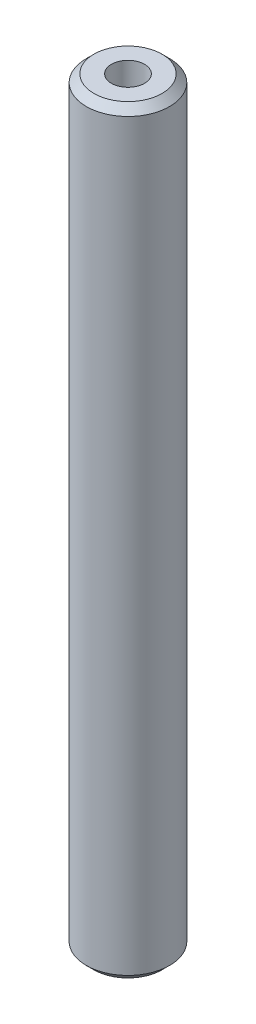
ISO-10303-21;
HEADER;
FILE_DESCRIPTION(('STEP AP214'),'2;1');
FILE_NAME('part.step','',(''),(''),'','','');
FILE_SCHEMA(('AUTOMOTIVE_DESIGN { 1 0 10303 214 1 1 1 1 }'));
ENDSEC;
DATA;
#1=APPLICATION_CONTEXT('core data for automotive mechanical design processes');
#2=APPLICATION_PROTOCOL_DEFINITION('international standard','automotive_design',2000,#1);
#3=PRODUCT_CONTEXT('',#1,'mechanical');
#4=PRODUCT('Part','Part','',(#3));
#5=PRODUCT_RELATED_PRODUCT_CATEGORY('part','',(#4));
#6=PRODUCT_DEFINITION_FORMATION('','',#4);
#7=PRODUCT_DEFINITION_CONTEXT('part definition',#1,'design');
#8=PRODUCT_DEFINITION('design','',#6,#7);
#9=PRODUCT_DEFINITION_SHAPE('','',#8);
#10=(LENGTH_UNIT() NAMED_UNIT(*) SI_UNIT(.MILLI.,.METRE.));
#11=(NAMED_UNIT(*) PLANE_ANGLE_UNIT() SI_UNIT($,.RADIAN.));
#12=(NAMED_UNIT(*) SI_UNIT($,.STERADIAN.) SOLID_ANGLE_UNIT());
#13=UNCERTAINTY_MEASURE_WITH_UNIT(LENGTH_MEASURE(1.E-05),#10,'distance_accuracy_value','');
#14=(GEOMETRIC_REPRESENTATION_CONTEXT(3) GLOBAL_UNCERTAINTY_ASSIGNED_CONTEXT((#13)) GLOBAL_UNIT_ASSIGNED_CONTEXT((#10,
#11,#12)) REPRESENTATION_CONTEXT('',''));
#15=CARTESIAN_POINT('',(0.,0.,0.));
#16=DIRECTION('',(0.,0.,1.));
#17=DIRECTION('',(1.,0.,0.));
#18=AXIS2_PLACEMENT_3D('',#15,#16,#17);
#19=CARTESIAN_POINT('',(0.,273.53104968137,0.));
#20=DIRECTION('',(0.,-1.,0.));
#21=DIRECTION('',(0.,0.,-1.));
#22=AXIS2_PLACEMENT_3D('',#19,#20,#21);
#23=CYLINDRICAL_SURFACE('',#22,15.);
#24=CARTESIAN_POINT('',(0.,270.806832955835,0.));
#25=DIRECTION('',(0.,1.,0.));
#26=DIRECTION('',(0.,0.,1.));
#27=AXIS2_PLACEMENT_3D('',#24,#25,#26);
#28=CIRCLE('',#27,15.);
#29=CARTESIAN_POINT('',(0.,270.806832955835,15.));
#30=VERTEX_POINT('',#29);
#31=EDGE_CURVE('E50',#30,#30,#28,.F.);
#32=ORIENTED_EDGE('',*,*,#31,.T.);
#33=EDGE_LOOP('',(#32));
#34=FACE_BOUND('',#33,.T.);
#35=CARTESIAN_POINT('',(0.,2.72421672553536,0.));
#36=DIRECTION('',(0.,1.,0.));
#37=DIRECTION('',(0.,0.,1.));
#38=AXIS2_PLACEMENT_3D('',#35,#36,#37);
#39=CIRCLE('',#38,15.);
#40=CARTESIAN_POINT('',(0.,2.72421672553536,15.));
#41=VERTEX_POINT('',#40);
#42=EDGE_CURVE('E51',#41,#41,#39,.T.);
#43=ORIENTED_EDGE('',*,*,#42,.T.);
#44=EDGE_LOOP('',(#43));
#45=FACE_BOUND('',#44,.T.);
#46=ADVANCED_FACE('F39',(#34,#45),#23,.T.);
#47=CARTESIAN_POINT('',(0.,273.53104968137,0.));
#48=DIRECTION('',(0.,1.,0.));
#49=DIRECTION('',(0.,0.,1.));
#50=AXIS2_PLACEMENT_3D('',#47,#48,#49);
#51=PLANE('',#50);
#52=CARTESIAN_POINT('',(0.,273.53104968137,0.));
#53=DIRECTION('',(0.,1.,0.));
#54=DIRECTION('',(0.,0.,1.));
#55=AXIS2_PLACEMENT_3D('',#52,#53,#54);
#56=CIRCLE('',#55,12.2757832744646);
#57=CARTESIAN_POINT('',(0.,273.53104968137,12.2757832744646));
#58=VERTEX_POINT('',#57);
#59=EDGE_CURVE('E54',#58,#58,#56,.T.);
#60=ORIENTED_EDGE('',*,*,#59,.T.);
#61=EDGE_LOOP('',(#60));
#62=FACE_BOUND('',#61,.T.);
#63=CARTESIAN_POINT('',(0.,273.53104968137,0.));
#64=DIRECTION('',(0.,1.,0.));
#65=DIRECTION('',(0.,0.,1.));
#66=AXIS2_PLACEMENT_3D('',#63,#64,#65);
#67=CIRCLE('',#66,5.9628341875996);
#68=CARTESIAN_POINT('',(0.,273.53104968137,5.9628341875996));
#69=VERTEX_POINT('',#68);
#70=EDGE_CURVE('E58',#69,#69,#67,.T.);
#71=ORIENTED_EDGE('',*,*,#70,.F.);
#72=EDGE_LOOP('',(#71));
#73=FACE_BOUND('',#72,.T.);
#74=ADVANCED_FACE('F69',(#62,#73),#51,.T.);
#75=CARTESIAN_POINT('',(0.,0.,0.));
#76=DIRECTION('',(0.,1.,0.));
#77=DIRECTION('',(0.,0.,1.));
#78=AXIS2_PLACEMENT_3D('',#75,#76,#77);
#79=PLANE('',#78);
#80=CARTESIAN_POINT('',(0.,0.,0.));
#81=DIRECTION('',(0.,1.,0.));
#82=DIRECTION('',(0.,0.,1.));
#83=AXIS2_PLACEMENT_3D('',#80,#81,#82);
#84=CIRCLE('',#83,12.2757832744646);
#85=CARTESIAN_POINT('',(0.,0.,12.2757832744646));
#86=VERTEX_POINT('',#85);
#87=EDGE_CURVE('E10',#86,#86,#84,.F.);
#88=ORIENTED_EDGE('',*,*,#87,.T.);
#89=EDGE_LOOP('',(#88));
#90=FACE_BOUND('',#89,.T.);
#91=CARTESIAN_POINT('',(0.,0.,0.));
#92=DIRECTION('',(0.,1.,0.));
#93=DIRECTION('',(0.,0.,1.));
#94=AXIS2_PLACEMENT_3D('',#91,#92,#93);
#95=CIRCLE('',#94,5.9628341875996);
#96=CARTESIAN_POINT('',(0.,0.,5.9628341875996));
#97=VERTEX_POINT('',#96);
#98=EDGE_CURVE('E63',#97,#97,#95,.T.);
#99=ORIENTED_EDGE('',*,*,#98,.T.);
#100=EDGE_LOOP('',(#99));
#101=FACE_BOUND('',#100,.T.);
#102=ADVANCED_FACE('F75',(#90,#101),#79,.F.);
#103=CARTESIAN_POINT('',(0.,273.53104968137,0.));
#104=DIRECTION('',(0.,-1.,0.));
#105=DIRECTION('',(0.,0.,-1.));
#106=AXIS2_PLACEMENT_3D('',#103,#104,#105);
#107=CYLINDRICAL_SURFACE('',#106,5.9628341875996);
#108=ORIENTED_EDGE('',*,*,#70,.T.);
#109=EDGE_LOOP('',(#108));
#110=FACE_BOUND('',#109,.T.);
#111=ORIENTED_EDGE('',*,*,#98,.F.);
#112=EDGE_LOOP('',(#111));
#113=FACE_BOUND('',#112,.T.);
#114=ADVANCED_FACE('F70',(#110,#113),#107,.F.);
#115=CARTESIAN_POINT('',(0.,273.53104968137,0.));
#116=DIRECTION('',(0.,-1.,0.));
#117=DIRECTION('',(0.,0.,-1.));
#118=AXIS2_PLACEMENT_3D('',#115,#116,#117);
#119=CONICAL_SURFACE('',#118,12.2757832744646,0.785398163397451);
#120=ORIENTED_EDGE('',*,*,#31,.F.);
#121=EDGE_LOOP('',(#120));
#122=FACE_BOUND('',#121,.T.);
#123=ORIENTED_EDGE('',*,*,#59,.F.);
#124=EDGE_LOOP('',(#123));
#125=FACE_BOUND('',#124,.T.);
#126=ADVANCED_FACE('F81',(#122,#125),#119,.T.);
#127=CARTESIAN_POINT('',(0.,2.72421672553536,0.));
#128=DIRECTION('',(0.,1.,0.));
#129=DIRECTION('',(0.,0.,1.));
#130=AXIS2_PLACEMENT_3D('',#127,#128,#129);
#131=CONICAL_SURFACE('',#130,15.,0.785398163397456);
#132=ORIENTED_EDGE('',*,*,#87,.F.);
#133=EDGE_LOOP('',(#132));
#134=FACE_BOUND('',#133,.T.);
#135=ORIENTED_EDGE('',*,*,#42,.F.);
#136=EDGE_LOOP('',(#135));
#137=FACE_BOUND('',#136,.T.);
#138=ADVANCED_FACE('F45',(#134,#137),#131,.T.);
#139=CLOSED_SHELL('',(#46,#74,#102,#114,#126,#138));
#140=MANIFOLD_SOLID_BREP('B2',#139);
#141=ADVANCED_BREP_SHAPE_REPRESENTATION('',(#18,#140),#14);
#142=SHAPE_DEFINITION_REPRESENTATION(#9,#141);
ENDSEC;
END-ISO-10303-21;
